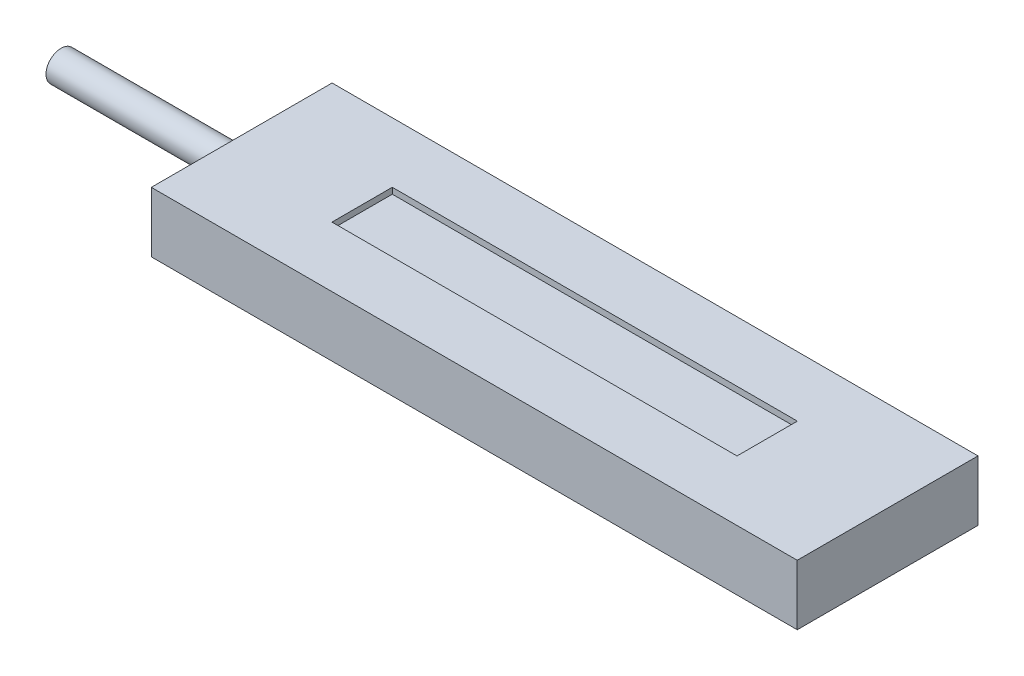
ISO-10303-21;
HEADER;
FILE_DESCRIPTION(('STEP AP214'),'2;1');
FILE_NAME('part.step','',(''),(''),'','','');
FILE_SCHEMA(('AUTOMOTIVE_DESIGN { 1 0 10303 214 1 1 1 1 }'));
ENDSEC;
DATA;
#1=APPLICATION_CONTEXT('core data for automotive mechanical design processes');
#2=APPLICATION_PROTOCOL_DEFINITION('international standard','automotive_design',2000,#1);
#3=PRODUCT_CONTEXT('',#1,'mechanical');
#4=PRODUCT('Part','Part','',(#3));
#5=PRODUCT_RELATED_PRODUCT_CATEGORY('part','',(#4));
#6=PRODUCT_DEFINITION_FORMATION('','',#4);
#7=PRODUCT_DEFINITION_CONTEXT('part definition',#1,'design');
#8=PRODUCT_DEFINITION('design','',#6,#7);
#9=PRODUCT_DEFINITION_SHAPE('','',#8);
#10=(LENGTH_UNIT() NAMED_UNIT(*) SI_UNIT(.MILLI.,.METRE.));
#11=(NAMED_UNIT(*) PLANE_ANGLE_UNIT() SI_UNIT($,.RADIAN.));
#12=(NAMED_UNIT(*) SI_UNIT($,.STERADIAN.) SOLID_ANGLE_UNIT());
#13=UNCERTAINTY_MEASURE_WITH_UNIT(LENGTH_MEASURE(1.E-05),#10,'distance_accuracy_value','');
#14=(GEOMETRIC_REPRESENTATION_CONTEXT(3) GLOBAL_UNCERTAINTY_ASSIGNED_CONTEXT((#13)) GLOBAL_UNIT_ASSIGNED_CONTEXT((#10,
#11,#12)) REPRESENTATION_CONTEXT('',''));
#15=CARTESIAN_POINT('',(0.,0.,0.));
#16=DIRECTION('',(0.,0.,1.));
#17=DIRECTION('',(1.,0.,0.));
#18=AXIS2_PLACEMENT_3D('',#15,#16,#17);
#19=CARTESIAN_POINT('',(0.,10.,0.));
#20=DIRECTION('',(1.,0.,0.));
#21=DIRECTION('',(0.,0.,-1.));
#22=AXIS2_PLACEMENT_3D('',#19,#20,#21);
#23=PLANE('',#22);
#24=CARTESIAN_POINT('',(0.,5.,-15.01));
#25=DIRECTION('',(-1.,0.,0.));
#26=DIRECTION('',(0.,0.,1.));
#27=AXIS2_PLACEMENT_3D('',#24,#25,#26);
#28=CIRCLE('',#27,2.5);
#29=CARTESIAN_POINT('',(0.,5.,-12.51));
#30=VERTEX_POINT('',#29);
#31=EDGE_CURVE('E11',#30,#30,#28,.T.);
#32=ORIENTED_EDGE('',*,*,#31,.F.);
#33=EDGE_LOOP('',(#32));
#34=FACE_BOUND('',#33,.T.);
#35=DIRECTION('',(0.,0.,1.));
#36=VECTOR('',#35,1.);
#37=CARTESIAN_POINT('',(0.,0.,0.));
#38=LINE('',#37,#36);
#39=CARTESIAN_POINT('',(0.,0.,-30.02));
#40=VERTEX_POINT('',#39);
#41=CARTESIAN_POINT('',(0.,0.,0.));
#42=VERTEX_POINT('',#41);
#43=EDGE_CURVE('E167',#40,#42,#38,.T.);
#44=ORIENTED_EDGE('',*,*,#43,.T.);
#45=DIRECTION('',(0.,-1.,0.));
#46=VECTOR('',#45,1.);
#47=CARTESIAN_POINT('',(0.,10.,0.));
#48=LINE('',#47,#46);
#49=CARTESIAN_POINT('',(0.,10.,0.));
#50=VERTEX_POINT('',#49);
#51=EDGE_CURVE('E41',#50,#42,#48,.T.);
#52=ORIENTED_EDGE('',*,*,#51,.F.);
#53=DIRECTION('',(0.,0.,1.));
#54=VECTOR('',#53,1.);
#55=CARTESIAN_POINT('',(0.,10.,0.));
#56=LINE('',#55,#54);
#57=CARTESIAN_POINT('',(0.,10.,-30.02));
#58=VERTEX_POINT('',#57);
#59=EDGE_CURVE('E169',#58,#50,#56,.T.);
#60=ORIENTED_EDGE('',*,*,#59,.F.);
#61=DIRECTION('',(0.,-1.,0.));
#62=VECTOR('',#61,1.);
#63=CARTESIAN_POINT('',(0.,10.,-30.02));
#64=LINE('',#63,#62);
#65=EDGE_CURVE('E179',#58,#40,#64,.T.);
#66=ORIENTED_EDGE('',*,*,#65,.T.);
#67=EDGE_LOOP('',(#44,#52,#60,#66));
#68=FACE_BOUND('',#67,.T.);
#69=ADVANCED_FACE('F38',(#34,#68),#23,.F.);
#70=CARTESIAN_POINT('',(0.,10.,0.));
#71=DIRECTION('',(0.,0.,-1.));
#72=DIRECTION('',(-1.,0.,0.));
#73=AXIS2_PLACEMENT_3D('',#70,#71,#72);
#74=PLANE('',#73);
#75=DIRECTION('',(1.,0.,0.));
#76=VECTOR('',#75,1.);
#77=CARTESIAN_POINT('',(0.,0.,0.));
#78=LINE('',#77,#76);
#79=CARTESIAN_POINT('',(107.27,0.,0.));
#80=VERTEX_POINT('',#79);
#81=EDGE_CURVE('E183',#42,#80,#78,.T.);
#82=ORIENTED_EDGE('',*,*,#81,.T.);
#83=DIRECTION('',(0.,-1.,0.));
#84=VECTOR('',#83,1.);
#85=CARTESIAN_POINT('',(107.27,10.,0.));
#86=LINE('',#85,#84);
#87=CARTESIAN_POINT('',(107.27,10.,0.));
#88=VERTEX_POINT('',#87);
#89=EDGE_CURVE('E195',#88,#80,#86,.T.);
#90=ORIENTED_EDGE('',*,*,#89,.F.);
#91=DIRECTION('',(1.,0.,0.));
#92=VECTOR('',#91,1.);
#93=CARTESIAN_POINT('',(0.,10.,0.));
#94=LINE('',#93,#92);
#95=EDGE_CURVE('E92',#50,#88,#94,.T.);
#96=ORIENTED_EDGE('',*,*,#95,.F.);
#97=ORIENTED_EDGE('',*,*,#51,.T.);
#98=EDGE_LOOP('',(#82,#90,#96,#97));
#99=FACE_BOUND('',#98,.T.);
#100=ADVANCED_FACE('F203',(#99),#74,.F.);
#101=CARTESIAN_POINT('',(107.27,10.,0.));
#102=DIRECTION('',(-1.,0.,0.));
#103=DIRECTION('',(0.,0.,1.));
#104=AXIS2_PLACEMENT_3D('',#101,#102,#103);
#105=PLANE('',#104);
#106=DIRECTION('',(0.,0.,-1.));
#107=VECTOR('',#106,1.);
#108=CARTESIAN_POINT('',(107.27,0.,0.));
#109=LINE('',#108,#107);
#110=CARTESIAN_POINT('',(107.27,0.,-30.02));
#111=VERTEX_POINT('',#110);
#112=EDGE_CURVE('E186',#80,#111,#109,.T.);
#113=ORIENTED_EDGE('',*,*,#112,.T.);
#114=DIRECTION('',(0.,-1.,0.));
#115=VECTOR('',#114,1.);
#116=CARTESIAN_POINT('',(107.27,10.,-30.02));
#117=LINE('',#116,#115);
#118=CARTESIAN_POINT('',(107.27,10.,-30.02));
#119=VERTEX_POINT('',#118);
#120=EDGE_CURVE('E193',#119,#111,#117,.T.);
#121=ORIENTED_EDGE('',*,*,#120,.F.);
#122=DIRECTION('',(0.,0.,-1.));
#123=VECTOR('',#122,1.);
#124=CARTESIAN_POINT('',(107.27,10.,0.));
#125=LINE('',#124,#123);
#126=EDGE_CURVE('E174',#88,#119,#125,.T.);
#127=ORIENTED_EDGE('',*,*,#126,.F.);
#128=ORIENTED_EDGE('',*,*,#89,.T.);
#129=EDGE_LOOP('',(#113,#121,#127,#128));
#130=FACE_BOUND('',#129,.T.);
#131=ADVANCED_FACE('F210',(#130),#105,.F.);
#132=CARTESIAN_POINT('',(0.,10.,-30.02));
#133=DIRECTION('',(0.,0.,1.));
#134=DIRECTION('',(1.,0.,0.));
#135=AXIS2_PLACEMENT_3D('',#132,#133,#134);
#136=PLANE('',#135);
#137=DIRECTION('',(-1.,0.,0.));
#138=VECTOR('',#137,1.);
#139=CARTESIAN_POINT('',(0.,0.,-30.02));
#140=LINE('',#139,#138);
#141=EDGE_CURVE('E84',#111,#40,#140,.T.);
#142=ORIENTED_EDGE('',*,*,#141,.T.);
#143=ORIENTED_EDGE('',*,*,#65,.F.);
#144=DIRECTION('',(-1.,0.,0.));
#145=VECTOR('',#144,1.);
#146=CARTESIAN_POINT('',(0.,10.,-30.02));
#147=LINE('',#146,#145);
#148=EDGE_CURVE('E63',#119,#58,#147,.T.);
#149=ORIENTED_EDGE('',*,*,#148,.F.);
#150=ORIENTED_EDGE('',*,*,#120,.T.);
#151=EDGE_LOOP('',(#142,#143,#149,#150));
#152=FACE_BOUND('',#151,.T.);
#153=ADVANCED_FACE('F211',(#152),#136,.F.);
#154=CARTESIAN_POINT('',(0.,10.,0.));
#155=DIRECTION('',(0.,-1.,0.));
#156=DIRECTION('',(0.,0.,-1.));
#157=AXIS2_PLACEMENT_3D('',#154,#155,#156);
#158=PLANE('',#157);
#159=DIRECTION('',(1.,0.,0.));
#160=VECTOR('',#159,1.);
#161=CARTESIAN_POINT('',(20.,10.,-10.));
#162=LINE('',#161,#160);
#163=CARTESIAN_POINT('',(20.,10.,-10.));
#164=VERTEX_POINT('',#163);
#165=CARTESIAN_POINT('',(87.27,10.,-10.));
#166=VERTEX_POINT('',#165);
#167=EDGE_CURVE('E150',#164,#166,#162,.T.);
#168=ORIENTED_EDGE('',*,*,#167,.F.);
#169=DIRECTION('',(0.,0.,1.));
#170=VECTOR('',#169,1.);
#171=CARTESIAN_POINT('',(20.,10.,-20.02));
#172=LINE('',#171,#170);
#173=CARTESIAN_POINT('',(20.,10.,-20.02));
#174=VERTEX_POINT('',#173);
#175=EDGE_CURVE('E54',#174,#164,#172,.T.);
#176=ORIENTED_EDGE('',*,*,#175,.F.);
#177=DIRECTION('',(-1.,0.,0.));
#178=VECTOR('',#177,1.);
#179=CARTESIAN_POINT('',(20.,10.,-20.02));
#180=LINE('',#179,#178);
#181=CARTESIAN_POINT('',(87.27,10.,-20.02));
#182=VERTEX_POINT('',#181);
#183=EDGE_CURVE('E137',#182,#174,#180,.T.);
#184=ORIENTED_EDGE('',*,*,#183,.F.);
#185=DIRECTION('',(0.,0.,-1.));
#186=VECTOR('',#185,1.);
#187=CARTESIAN_POINT('',(87.27,10.,-20.02));
#188=LINE('',#187,#186);
#189=EDGE_CURVE('E141',#166,#182,#188,.T.);
#190=ORIENTED_EDGE('',*,*,#189,.F.);
#191=EDGE_LOOP('',(#168,#176,#184,#190));
#192=FACE_BOUND('',#191,.T.);
#193=ORIENTED_EDGE('',*,*,#59,.T.);
#194=ORIENTED_EDGE('',*,*,#95,.T.);
#195=ORIENTED_EDGE('',*,*,#126,.T.);
#196=ORIENTED_EDGE('',*,*,#148,.T.);
#197=EDGE_LOOP('',(#193,#194,#195,#196));
#198=FACE_BOUND('',#197,.T.);
#199=ADVANCED_FACE('F212',(#192,#198),#158,.F.);
#200=CARTESIAN_POINT('',(0.,0.,0.));
#201=DIRECTION('',(0.,-1.,0.));
#202=DIRECTION('',(0.,0.,-1.));
#203=AXIS2_PLACEMENT_3D('',#200,#201,#202);
#204=PLANE('',#203);
#205=ORIENTED_EDGE('',*,*,#43,.F.);
#206=ORIENTED_EDGE('',*,*,#141,.F.);
#207=ORIENTED_EDGE('',*,*,#112,.F.);
#208=ORIENTED_EDGE('',*,*,#81,.F.);
#209=EDGE_LOOP('',(#205,#206,#207,#208));
#210=FACE_BOUND('',#209,.T.);
#211=ADVANCED_FACE('F208',(#210),#204,.T.);
#212=CARTESIAN_POINT('',(-30.,5.,-15.01));
#213=DIRECTION('',(1.,0.,0.));
#214=DIRECTION('',(0.,0.,-1.));
#215=AXIS2_PLACEMENT_3D('',#212,#213,#214);
#216=CYLINDRICAL_SURFACE('',#215,2.5);
#217=CARTESIAN_POINT('',(-30.,5.,-15.01));
#218=DIRECTION('',(-1.,0.,0.));
#219=DIRECTION('',(0.,0.,1.));
#220=AXIS2_PLACEMENT_3D('',#217,#218,#219);
#221=CIRCLE('',#220,2.5);
#222=CARTESIAN_POINT('',(-30.,5.,-12.51));
#223=VERTEX_POINT('',#222);
#224=EDGE_CURVE('E159',#223,#223,#221,.T.);
#225=ORIENTED_EDGE('',*,*,#224,.F.);
#226=EDGE_LOOP('',(#225));
#227=FACE_BOUND('',#226,.T.);
#228=ORIENTED_EDGE('',*,*,#31,.T.);
#229=EDGE_LOOP('',(#228));
#230=FACE_BOUND('',#229,.T.);
#231=ADVANCED_FACE('F221',(#227,#230),#216,.T.);
#232=CARTESIAN_POINT('',(-30.,5.,-15.01));
#233=DIRECTION('',(-1.,0.,0.));
#234=DIRECTION('',(0.,0.,1.));
#235=AXIS2_PLACEMENT_3D('',#232,#233,#234);
#236=PLANE('',#235);
#237=ORIENTED_EDGE('',*,*,#224,.T.);
#238=EDGE_LOOP('',(#237));
#239=FACE_BOUND('',#238,.T.);
#240=ADVANCED_FACE('F234',(#239),#236,.T.);
#241=CARTESIAN_POINT('',(20.,9.,-20.02));
#242=DIRECTION('',(-1.,0.,0.));
#243=DIRECTION('',(0.,0.,1.));
#244=AXIS2_PLACEMENT_3D('',#241,#242,#243);
#245=PLANE('',#244);
#246=ORIENTED_EDGE('',*,*,#175,.T.);
#247=DIRECTION('',(0.,1.,0.));
#248=VECTOR('',#247,1.);
#249=CARTESIAN_POINT('',(20.,9.,-10.));
#250=LINE('',#249,#248);
#251=CARTESIAN_POINT('',(20.,9.,-10.));
#252=VERTEX_POINT('',#251);
#253=EDGE_CURVE('E112',#252,#164,#250,.T.);
#254=ORIENTED_EDGE('',*,*,#253,.F.);
#255=DIRECTION('',(0.,0.,1.));
#256=VECTOR('',#255,1.);
#257=CARTESIAN_POINT('',(20.,9.,-20.02));
#258=LINE('',#257,#256);
#259=CARTESIAN_POINT('',(20.,9.,-20.02));
#260=VERTEX_POINT('',#259);
#261=EDGE_CURVE('E116',#260,#252,#258,.T.);
#262=ORIENTED_EDGE('',*,*,#261,.F.);
#263=DIRECTION('',(0.,1.,0.));
#264=VECTOR('',#263,1.);
#265=CARTESIAN_POINT('',(20.,9.,-20.02));
#266=LINE('',#265,#264);
#267=EDGE_CURVE('E156',#260,#174,#266,.T.);
#268=ORIENTED_EDGE('',*,*,#267,.T.);
#269=EDGE_LOOP('',(#246,#254,#262,#268));
#270=FACE_BOUND('',#269,.T.);
#271=ADVANCED_FACE('F114',(#270),#245,.F.);
#272=CARTESIAN_POINT('',(20.,9.,-20.02));
#273=DIRECTION('',(0.,0.,-1.));
#274=DIRECTION('',(-1.,0.,0.));
#275=AXIS2_PLACEMENT_3D('',#272,#273,#274);
#276=PLANE('',#275);
#277=ORIENTED_EDGE('',*,*,#183,.T.);
#278=ORIENTED_EDGE('',*,*,#267,.F.);
#279=DIRECTION('',(-1.,0.,0.));
#280=VECTOR('',#279,1.);
#281=CARTESIAN_POINT('',(20.,9.,-20.02));
#282=LINE('',#281,#280);
#283=CARTESIAN_POINT('',(87.27,9.,-20.02));
#284=VERTEX_POINT('',#283);
#285=EDGE_CURVE('E123',#284,#260,#282,.T.);
#286=ORIENTED_EDGE('',*,*,#285,.F.);
#287=DIRECTION('',(0.,1.,0.));
#288=VECTOR('',#287,1.);
#289=CARTESIAN_POINT('',(87.27,9.,-20.02));
#290=LINE('',#289,#288);
#291=EDGE_CURVE('E160',#284,#182,#290,.T.);
#292=ORIENTED_EDGE('',*,*,#291,.T.);
#293=EDGE_LOOP('',(#277,#278,#286,#292));
#294=FACE_BOUND('',#293,.T.);
#295=ADVANCED_FACE('F245',(#294),#276,.F.);
#296=CARTESIAN_POINT('',(87.27,9.,-20.02));
#297=DIRECTION('',(1.,0.,0.));
#298=DIRECTION('',(0.,0.,-1.));
#299=AXIS2_PLACEMENT_3D('',#296,#297,#298);
#300=PLANE('',#299);
#301=ORIENTED_EDGE('',*,*,#189,.T.);
#302=ORIENTED_EDGE('',*,*,#291,.F.);
#303=DIRECTION('',(0.,0.,-1.));
#304=VECTOR('',#303,1.);
#305=CARTESIAN_POINT('',(87.27,9.,-20.02));
#306=LINE('',#305,#304);
#307=CARTESIAN_POINT('',(87.27,9.,-10.));
#308=VERTEX_POINT('',#307);
#309=EDGE_CURVE('E132',#308,#284,#306,.T.);
#310=ORIENTED_EDGE('',*,*,#309,.F.);
#311=DIRECTION('',(0.,1.,0.));
#312=VECTOR('',#311,1.);
#313=CARTESIAN_POINT('',(87.27,9.,-10.));
#314=LINE('',#313,#312);
#315=EDGE_CURVE('E122',#308,#166,#314,.T.);
#316=ORIENTED_EDGE('',*,*,#315,.T.);
#317=EDGE_LOOP('',(#301,#302,#310,#316));
#318=FACE_BOUND('',#317,.T.);
#319=ADVANCED_FACE('F248',(#318),#300,.F.);
#320=CARTESIAN_POINT('',(20.,9.,-10.));
#321=DIRECTION('',(0.,0.,1.));
#322=DIRECTION('',(1.,0.,0.));
#323=AXIS2_PLACEMENT_3D('',#320,#321,#322);
#324=PLANE('',#323);
#325=ORIENTED_EDGE('',*,*,#167,.T.);
#326=ORIENTED_EDGE('',*,*,#315,.F.);
#327=DIRECTION('',(1.,0.,0.));
#328=VECTOR('',#327,1.);
#329=CARTESIAN_POINT('',(20.,9.,-10.));
#330=LINE('',#329,#328);
#331=EDGE_CURVE('E126',#252,#308,#330,.T.);
#332=ORIENTED_EDGE('',*,*,#331,.F.);
#333=ORIENTED_EDGE('',*,*,#253,.T.);
#334=EDGE_LOOP('',(#325,#326,#332,#333));
#335=FACE_BOUND('',#334,.T.);
#336=ADVANCED_FACE('F127',(#335),#324,.F.);
#337=CARTESIAN_POINT('',(0.,9.,0.));
#338=DIRECTION('',(0.,1.,0.));
#339=DIRECTION('',(0.,0.,1.));
#340=AXIS2_PLACEMENT_3D('',#337,#338,#339);
#341=PLANE('',#340);
#342=ORIENTED_EDGE('',*,*,#261,.T.);
#343=ORIENTED_EDGE('',*,*,#331,.T.);
#344=ORIENTED_EDGE('',*,*,#309,.T.);
#345=ORIENTED_EDGE('',*,*,#285,.T.);
#346=EDGE_LOOP('',(#342,#343,#344,#345));
#347=FACE_BOUND('',#346,.T.);
#348=ADVANCED_FACE('F134',(#347),#341,.T.);
#349=CLOSED_SHELL('',(#69,#100,#131,#153,#199,#211,#231,#240,#271,#295,#319,#336,#348));
#350=MANIFOLD_SOLID_BREP('B2',#349);
#351=ADVANCED_BREP_SHAPE_REPRESENTATION('',(#18,#350),#14);
#352=SHAPE_DEFINITION_REPRESENTATION(#9,#351);
ENDSEC;
END-ISO-10303-21;
